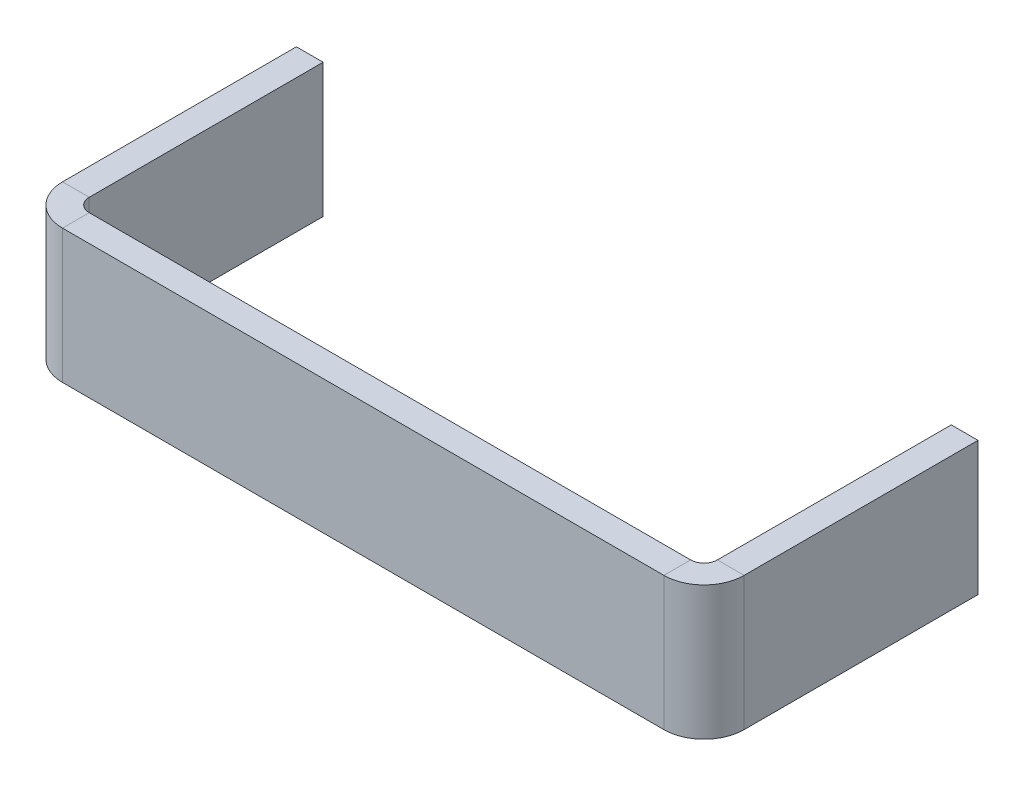
ISO-10303-21;
HEADER;
FILE_DESCRIPTION(('STEP AP214'),'2;1');
FILE_NAME('part.step','',(''),(''),'','','');
FILE_SCHEMA(('AUTOMOTIVE_DESIGN { 1 0 10303 214 1 1 1 1 }'));
ENDSEC;
DATA;
#1=APPLICATION_CONTEXT('core data for automotive mechanical design processes');
#2=APPLICATION_PROTOCOL_DEFINITION('international standard','automotive_design',2000,#1);
#3=PRODUCT_CONTEXT('',#1,'mechanical');
#4=PRODUCT('Part','Part','',(#3));
#5=PRODUCT_RELATED_PRODUCT_CATEGORY('part','',(#4));
#6=PRODUCT_DEFINITION_FORMATION('','',#4);
#7=PRODUCT_DEFINITION_CONTEXT('part definition',#1,'design');
#8=PRODUCT_DEFINITION('design','',#6,#7);
#9=PRODUCT_DEFINITION_SHAPE('','',#8);
#10=(LENGTH_UNIT() NAMED_UNIT(*) SI_UNIT(.MILLI.,.METRE.));
#11=(NAMED_UNIT(*) PLANE_ANGLE_UNIT() SI_UNIT($,.RADIAN.));
#12=(NAMED_UNIT(*) SI_UNIT($,.STERADIAN.) SOLID_ANGLE_UNIT());
#13=UNCERTAINTY_MEASURE_WITH_UNIT(LENGTH_MEASURE(1.E-05),#10,'distance_accuracy_value','');
#14=(GEOMETRIC_REPRESENTATION_CONTEXT(3) GLOBAL_UNCERTAINTY_ASSIGNED_CONTEXT((#13)) GLOBAL_UNIT_ASSIGNED_CONTEXT((#10,
#11,#12)) REPRESENTATION_CONTEXT('',''));
#15=CARTESIAN_POINT('',(0.,0.,0.));
#16=DIRECTION('',(0.,0.,1.));
#17=DIRECTION('',(1.,0.,0.));
#18=AXIS2_PLACEMENT_3D('',#15,#16,#17);
#19=CARTESIAN_POINT('',(1.5,10.,18.5));
#20=DIRECTION('',(0.,-1.,0.));
#21=DIRECTION('',(1.,0.,0.));
#22=AXIS2_PLACEMENT_3D('',#19,#20,#21);
#23=PLANE('',#22);
#24=DIRECTION('',(0.,0.,-1.));
#25=VECTOR('',#24,1.);
#26=CARTESIAN_POINT('',(2.5,10.,18.5));
#27=LINE('',#26,#25);
#28=CARTESIAN_POINT('',(2.5,10.,20.5));
#29=VERTEX_POINT('',#28);
#30=CARTESIAN_POINT('',(2.5,10.,18.5));
#31=VERTEX_POINT('',#30);
#32=EDGE_CURVE('E263',#29,#31,#27,.T.);
#33=ORIENTED_EDGE('',*,*,#32,.F.);
#34=DIRECTION('',(1.,0.,0.));
#35=VECTOR('',#34,1.);
#36=CARTESIAN_POINT('',(1.5,10.,20.5));
#37=LINE('',#36,#35);
#38=CARTESIAN_POINT('',(47.5,10.,20.5));
#39=VERTEX_POINT('',#38);
#40=EDGE_CURVE('E63',#29,#39,#37,.T.);
#41=ORIENTED_EDGE('',*,*,#40,.T.);
#42=DIRECTION('',(0.,0.,-1.));
#43=VECTOR('',#42,1.);
#44=CARTESIAN_POINT('',(47.5,10.,18.5));
#45=LINE('',#44,#43);
#46=CARTESIAN_POINT('',(47.5,10.,18.5));
#47=VERTEX_POINT('',#46);
#48=EDGE_CURVE('E271',#39,#47,#45,.T.);
#49=ORIENTED_EDGE('',*,*,#48,.T.);
#50=DIRECTION('',(1.,0.,0.));
#51=VECTOR('',#50,1.);
#52=CARTESIAN_POINT('',(1.5,10.,18.5));
#53=LINE('',#52,#51);
#54=EDGE_CURVE('E241',#31,#47,#53,.T.);
#55=ORIENTED_EDGE('',*,*,#54,.F.);
#56=EDGE_LOOP('',(#33,#41,#49,#55));
#57=FACE_BOUND('',#56,.T.);
#58=ADVANCED_FACE('F40',(#57),#23,.F.);
#59=CARTESIAN_POINT('',(0.,0.,18.5));
#60=DIRECTION('',(0.,-1.,0.));
#61=DIRECTION('',(1.,0.,0.));
#62=AXIS2_PLACEMENT_3D('',#59,#60,#61);
#63=PLANE('',#62);
#64=DIRECTION('',(0.,0.,-1.));
#65=VECTOR('',#64,1.);
#66=CARTESIAN_POINT('',(47.5,0.,18.5));
#67=LINE('',#66,#65);
#68=CARTESIAN_POINT('',(47.5,0.,20.5));
#69=VERTEX_POINT('',#68);
#70=CARTESIAN_POINT('',(47.5,0.,18.5));
#71=VERTEX_POINT('',#70);
#72=EDGE_CURVE('E11',#69,#71,#67,.T.);
#73=ORIENTED_EDGE('',*,*,#72,.F.);
#74=DIRECTION('',(1.,0.,0.));
#75=VECTOR('',#74,1.);
#76=CARTESIAN_POINT('',(1.5,0.,20.5));
#77=LINE('',#76,#75);
#78=CARTESIAN_POINT('',(2.5,0.,20.5));
#79=VERTEX_POINT('',#78);
#80=EDGE_CURVE('E55',#79,#69,#77,.T.);
#81=ORIENTED_EDGE('',*,*,#80,.F.);
#82=DIRECTION('',(0.,0.,-1.));
#83=VECTOR('',#82,1.);
#84=CARTESIAN_POINT('',(2.5,0.,18.5));
#85=LINE('',#84,#83);
#86=CARTESIAN_POINT('',(2.5,0.,18.5));
#87=VERTEX_POINT('',#86);
#88=EDGE_CURVE('E255',#79,#87,#85,.T.);
#89=ORIENTED_EDGE('',*,*,#88,.T.);
#90=DIRECTION('',(1.,0.,0.));
#91=VECTOR('',#90,1.);
#92=CARTESIAN_POINT('',(0.,0.,18.5));
#93=LINE('',#92,#91);
#94=EDGE_CURVE('E244',#87,#71,#93,.T.);
#95=ORIENTED_EDGE('',*,*,#94,.T.);
#96=EDGE_LOOP('',(#73,#81,#89,#95));
#97=FACE_BOUND('',#96,.T.);
#98=ADVANCED_FACE('F334',(#97),#63,.T.);
#99=CARTESIAN_POINT('',(1.5,-10.,18.5));
#100=DIRECTION('',(0.,0.,1.));
#101=DIRECTION('',(1.,0.,0.));
#102=AXIS2_PLACEMENT_3D('',#99,#100,#101);
#103=PLANE('',#102);
#104=ORIENTED_EDGE('',*,*,#54,.T.);
#105=DIRECTION('',(0.,-1.,0.));
#106=VECTOR('',#105,1.);
#107=CARTESIAN_POINT('',(47.5,0.,18.5));
#108=LINE('',#107,#106);
#109=EDGE_CURVE('E267',#47,#71,#108,.T.);
#110=ORIENTED_EDGE('',*,*,#109,.T.);
#111=ORIENTED_EDGE('',*,*,#94,.F.);
#112=DIRECTION('',(0.,1.,0.));
#113=VECTOR('',#112,1.);
#114=CARTESIAN_POINT('',(2.5,10.,18.5));
#115=LINE('',#114,#113);
#116=EDGE_CURVE('E247',#87,#31,#115,.T.);
#117=ORIENTED_EDGE('',*,*,#116,.T.);
#118=EDGE_LOOP('',(#104,#110,#111,#117));
#119=FACE_BOUND('',#118,.T.);
#120=ADVANCED_FACE('F288',(#119),#103,.F.);
#121=CARTESIAN_POINT('',(1.5,-10.,20.5));
#122=DIRECTION('',(0.,0.,1.));
#123=DIRECTION('',(1.,0.,0.));
#124=AXIS2_PLACEMENT_3D('',#121,#122,#123);
#125=PLANE('',#124);
#126=ORIENTED_EDGE('',*,*,#40,.F.);
#127=DIRECTION('',(0.,1.,0.));
#128=VECTOR('',#127,1.);
#129=CARTESIAN_POINT('',(2.5,-10.,20.5));
#130=LINE('',#129,#128);
#131=EDGE_CURVE('E259',#79,#29,#130,.T.);
#132=ORIENTED_EDGE('',*,*,#131,.F.);
#133=ORIENTED_EDGE('',*,*,#80,.T.);
#134=DIRECTION('',(0.,-1.,0.));
#135=VECTOR('',#134,1.);
#136=CARTESIAN_POINT('',(47.5,-10.,20.5));
#137=LINE('',#136,#135);
#138=EDGE_CURVE('E48',#39,#69,#137,.T.);
#139=ORIENTED_EDGE('',*,*,#138,.F.);
#140=EDGE_LOOP('',(#126,#132,#133,#139));
#141=FACE_BOUND('',#140,.T.);
#142=ADVANCED_FACE('F281',(#141),#125,.T.);
#143=CARTESIAN_POINT('',(2.5,10.,17.5));
#144=DIRECTION('',(0.,-1.,0.));
#145=DIRECTION('',(0.,0.,-1.));
#146=AXIS2_PLACEMENT_3D('',#143,#144,#145);
#147=PLANE('',#146);
#148=DIRECTION('',(1.,0.,0.));
#149=VECTOR('',#148,1.);
#150=CARTESIAN_POINT('',(1.49999999999999,10.,17.5));
#151=LINE('',#150,#149);
#152=CARTESIAN_POINT('',(-0.500000000000007,10.,17.5));
#153=VERTEX_POINT('',#152);
#154=CARTESIAN_POINT('',(1.49999999999999,10.,17.5));
#155=VERTEX_POINT('',#154);
#156=EDGE_CURVE('E184',#153,#155,#151,.T.);
#157=ORIENTED_EDGE('',*,*,#156,.F.);
#158=CARTESIAN_POINT('',(2.5,10.,17.5));
#159=DIRECTION('',(0.,1.,0.));
#160=DIRECTION('',(0.,0.,1.));
#161=AXIS2_PLACEMENT_3D('',#158,#159,#160);
#162=CIRCLE('',#161,3.);
#163=EDGE_CURVE('E188',#153,#29,#162,.T.);
#164=ORIENTED_EDGE('',*,*,#163,.T.);
#165=ORIENTED_EDGE('',*,*,#32,.T.);
#166=CARTESIAN_POINT('',(2.5,10.,17.5));
#167=DIRECTION('',(0.,1.,0.));
#168=DIRECTION('',(0.,0.,1.));
#169=AXIS2_PLACEMENT_3D('',#166,#167,#168);
#170=CIRCLE('',#169,1.);
#171=EDGE_CURVE('E226',#155,#31,#170,.T.);
#172=ORIENTED_EDGE('',*,*,#171,.F.);
#173=EDGE_LOOP('',(#157,#164,#165,#172));
#174=FACE_BOUND('',#173,.T.);
#175=ADVANCED_FACE('F294',(#174),#147,.F.);
#176=CARTESIAN_POINT('',(2.5,0.,17.5));
#177=DIRECTION('',(0.,1.,0.));
#178=DIRECTION('',(0.,0.,1.));
#179=AXIS2_PLACEMENT_3D('',#176,#177,#178);
#180=PLANE('',#179);
#181=ORIENTED_EDGE('',*,*,#88,.F.);
#182=CARTESIAN_POINT('',(2.5,0.,17.5));
#183=DIRECTION('',(0.,1.,0.));
#184=DIRECTION('',(0.,0.,1.));
#185=AXIS2_PLACEMENT_3D('',#182,#183,#184);
#186=CIRCLE('',#185,3.);
#187=CARTESIAN_POINT('',(-0.500000000000007,0.,17.5));
#188=VERTEX_POINT('',#187);
#189=EDGE_CURVE('E231',#79,#188,#186,.F.);
#190=ORIENTED_EDGE('',*,*,#189,.T.);
#191=DIRECTION('',(1.,0.,0.));
#192=VECTOR('',#191,1.);
#193=CARTESIAN_POINT('',(1.49999999999999,0.,17.5));
#194=LINE('',#193,#192);
#195=CARTESIAN_POINT('',(1.5,0.,17.5));
#196=VERTEX_POINT('',#195);
#197=EDGE_CURVE('E219',#188,#196,#194,.T.);
#198=ORIENTED_EDGE('',*,*,#197,.T.);
#199=CARTESIAN_POINT('',(2.5,0.,17.5));
#200=DIRECTION('',(0.,-1.,0.));
#201=DIRECTION('',(0.,0.,-1.));
#202=AXIS2_PLACEMENT_3D('',#199,#200,#201);
#203=CIRCLE('',#202,1.);
#204=EDGE_CURVE('E230',#87,#196,#203,.T.);
#205=ORIENTED_EDGE('',*,*,#204,.F.);
#206=EDGE_LOOP('',(#181,#190,#198,#205));
#207=FACE_BOUND('',#206,.T.);
#208=ADVANCED_FACE('F309',(#207),#180,.F.);
#209=CARTESIAN_POINT('',(2.5,-5.67097017150219,17.5));
#210=DIRECTION('',(0.,1.,0.));
#211=DIRECTION('',(0.,0.,1.));
#212=AXIS2_PLACEMENT_3D('',#209,#210,#211);
#213=CYLINDRICAL_SURFACE('',#212,1.);
#214=ORIENTED_EDGE('',*,*,#204,.T.);
#215=DIRECTION('',(0.,-1.,0.));
#216=VECTOR('',#215,1.);
#217=CARTESIAN_POINT('',(1.49999999999999,0.,17.5));
#218=LINE('',#217,#216);
#219=EDGE_CURVE('E206',#155,#196,#218,.T.);
#220=ORIENTED_EDGE('',*,*,#219,.F.);
#221=ORIENTED_EDGE('',*,*,#171,.T.);
#222=ORIENTED_EDGE('',*,*,#116,.F.);
#223=EDGE_LOOP('',(#214,#220,#221,#222));
#224=FACE_BOUND('',#223,.T.);
#225=ADVANCED_FACE('F297',(#224),#213,.F.);
#226=CARTESIAN_POINT('',(2.5,-5.67097017150219,17.5));
#227=DIRECTION('',(0.,1.,0.));
#228=DIRECTION('',(0.,0.,1.));
#229=AXIS2_PLACEMENT_3D('',#226,#227,#228);
#230=CYLINDRICAL_SURFACE('',#229,3.);
#231=ORIENTED_EDGE('',*,*,#189,.F.);
#232=ORIENTED_EDGE('',*,*,#131,.T.);
#233=ORIENTED_EDGE('',*,*,#163,.F.);
#234=DIRECTION('',(0.,-1.,0.));
#235=VECTOR('',#234,1.);
#236=CARTESIAN_POINT('',(-0.500000000000007,-10.,17.5));
#237=LINE('',#236,#235);
#238=EDGE_CURVE('E176',#153,#188,#237,.T.);
#239=ORIENTED_EDGE('',*,*,#238,.T.);
#240=EDGE_LOOP('',(#231,#232,#233,#239));
#241=FACE_BOUND('',#240,.T.);
#242=ADVANCED_FACE('F313',(#241),#230,.T.);
#243=CARTESIAN_POINT('',(1.49999999999999,0.,0.));
#244=DIRECTION('',(0.,0.,1.));
#245=DIRECTION('',(0.,1.,0.));
#246=AXIS2_PLACEMENT_3D('',#243,#244,#245);
#247=PLANE('',#246);
#248=DIRECTION('',(1.,0.,0.));
#249=VECTOR('',#248,1.);
#250=CARTESIAN_POINT('',(1.49999999999999,0.,0.));
#251=LINE('',#250,#249);
#252=CARTESIAN_POINT('',(-0.500000000000007,0.,0.));
#253=VERTEX_POINT('',#252);
#254=CARTESIAN_POINT('',(1.49999999999999,0.,0.));
#255=VERTEX_POINT('',#254);
#256=EDGE_CURVE('E199',#253,#255,#251,.T.);
#257=ORIENTED_EDGE('',*,*,#256,.F.);
#258=DIRECTION('',(0.,1.,0.));
#259=VECTOR('',#258,1.);
#260=CARTESIAN_POINT('',(-0.500000000000007,-10.,0.));
#261=LINE('',#260,#259);
#262=CARTESIAN_POINT('',(-0.500000000000007,10.,0.));
#263=VERTEX_POINT('',#262);
#264=EDGE_CURVE('E215',#253,#263,#261,.T.);
#265=ORIENTED_EDGE('',*,*,#264,.T.);
#266=DIRECTION('',(1.,0.,0.));
#267=VECTOR('',#266,1.);
#268=CARTESIAN_POINT('',(1.49999999999999,10.,0.));
#269=LINE('',#268,#267);
#270=CARTESIAN_POINT('',(1.49999999999999,10.,0.));
#271=VERTEX_POINT('',#270);
#272=EDGE_CURVE('E212',#263,#271,#269,.T.);
#273=ORIENTED_EDGE('',*,*,#272,.T.);
#274=DIRECTION('',(0.,1.,0.));
#275=VECTOR('',#274,1.);
#276=CARTESIAN_POINT('',(1.49999999999999,0.,0.));
#277=LINE('',#276,#275);
#278=EDGE_CURVE('E202',#255,#271,#277,.T.);
#279=ORIENTED_EDGE('',*,*,#278,.F.);
#280=EDGE_LOOP('',(#257,#265,#273,#279));
#281=FACE_BOUND('',#280,.T.);
#282=ADVANCED_FACE('F321',(#281),#247,.F.);
#283=CARTESIAN_POINT('',(1.49999999999999,-10.,0.));
#284=DIRECTION('',(-1.,0.,0.));
#285=DIRECTION('',(0.,0.,1.));
#286=AXIS2_PLACEMENT_3D('',#283,#284,#285);
#287=PLANE('',#286);
#288=DIRECTION('',(0.,0.,1.));
#289=VECTOR('',#288,1.);
#290=CARTESIAN_POINT('',(1.49999999999999,10.,0.));
#291=LINE('',#290,#289);
#292=EDGE_CURVE('E209',#271,#155,#291,.T.);
#293=ORIENTED_EDGE('',*,*,#292,.T.);
#294=ORIENTED_EDGE('',*,*,#219,.T.);
#295=DIRECTION('',(0.,0.,1.));
#296=VECTOR('',#295,1.);
#297=CARTESIAN_POINT('',(1.49999999999999,0.,20.));
#298=LINE('',#297,#296);
#299=EDGE_CURVE('E195',#255,#196,#298,.T.);
#300=ORIENTED_EDGE('',*,*,#299,.F.);
#301=ORIENTED_EDGE('',*,*,#278,.T.);
#302=EDGE_LOOP('',(#293,#294,#300,#301));
#303=FACE_BOUND('',#302,.T.);
#304=ADVANCED_FACE('F300',(#303),#287,.F.);
#305=CARTESIAN_POINT('',(1.49999999999999,0.,20.));
#306=DIRECTION('',(0.,-1.,0.));
#307=DIRECTION('',(0.,0.,1.));
#308=AXIS2_PLACEMENT_3D('',#305,#306,#307);
#309=PLANE('',#308);
#310=ORIENTED_EDGE('',*,*,#197,.F.);
#311=DIRECTION('',(0.,0.,1.));
#312=VECTOR('',#311,1.);
#313=CARTESIAN_POINT('',(-0.500000000000007,0.,0.));
#314=LINE('',#313,#312);
#315=EDGE_CURVE('E192',#253,#188,#314,.T.);
#316=ORIENTED_EDGE('',*,*,#315,.F.);
#317=ORIENTED_EDGE('',*,*,#256,.T.);
#318=ORIENTED_EDGE('',*,*,#299,.T.);
#319=EDGE_LOOP('',(#310,#316,#317,#318));
#320=FACE_BOUND('',#319,.T.);
#321=ADVANCED_FACE('F304',(#320),#309,.T.);
#322=CARTESIAN_POINT('',(-0.500000000000007,-10.,0.));
#323=DIRECTION('',(-1.,0.,0.));
#324=DIRECTION('',(0.,0.,1.));
#325=AXIS2_PLACEMENT_3D('',#322,#323,#324);
#326=PLANE('',#325);
#327=DIRECTION('',(0.,0.,1.));
#328=VECTOR('',#327,1.);
#329=CARTESIAN_POINT('',(-0.500000000000007,10.,0.));
#330=LINE('',#329,#328);
#331=EDGE_CURVE('E189',#263,#153,#330,.T.);
#332=ORIENTED_EDGE('',*,*,#331,.F.);
#333=ORIENTED_EDGE('',*,*,#264,.F.);
#334=ORIENTED_EDGE('',*,*,#315,.T.);
#335=ORIENTED_EDGE('',*,*,#238,.F.);
#336=EDGE_LOOP('',(#332,#333,#334,#335));
#337=FACE_BOUND('',#336,.T.);
#338=ADVANCED_FACE('F316',(#337),#326,.T.);
#339=CARTESIAN_POINT('',(1.49999999999999,10.,0.));
#340=DIRECTION('',(0.,-1.,0.));
#341=DIRECTION('',(0.,0.,1.));
#342=AXIS2_PLACEMENT_3D('',#339,#340,#341);
#343=PLANE('',#342);
#344=ORIENTED_EDGE('',*,*,#272,.F.);
#345=ORIENTED_EDGE('',*,*,#331,.T.);
#346=ORIENTED_EDGE('',*,*,#156,.T.);
#347=ORIENTED_EDGE('',*,*,#292,.F.);
#348=EDGE_LOOP('',(#344,#345,#346,#347));
#349=FACE_BOUND('',#348,.T.);
#350=ADVANCED_FACE('F319',(#349),#343,.F.);
#351=CARTESIAN_POINT('',(47.5,10.,17.5));
#352=DIRECTION('',(0.,-1.,0.));
#353=DIRECTION('',(0.,0.,-1.));
#354=AXIS2_PLACEMENT_3D('',#351,#352,#353);
#355=PLANE('',#354);
#356=ORIENTED_EDGE('',*,*,#48,.F.);
#357=CARTESIAN_POINT('',(47.5,10.,17.5));
#358=DIRECTION('',(0.,-1.,0.));
#359=DIRECTION('',(0.,0.,-1.));
#360=AXIS2_PLACEMENT_3D('',#357,#358,#359);
#361=CIRCLE('',#360,3.);
#362=CARTESIAN_POINT('',(50.5,10.,17.5));
#363=VERTEX_POINT('',#362);
#364=EDGE_CURVE('E180',#39,#363,#361,.F.);
#365=ORIENTED_EDGE('',*,*,#364,.T.);
#366=DIRECTION('',(-1.,0.,0.));
#367=VECTOR('',#366,1.);
#368=CARTESIAN_POINT('',(48.5,10.,17.5));
#369=LINE('',#368,#367);
#370=CARTESIAN_POINT('',(48.5,10.,17.5));
#371=VERTEX_POINT('',#370);
#372=EDGE_CURVE('E157',#363,#371,#369,.T.);
#373=ORIENTED_EDGE('',*,*,#372,.T.);
#374=CARTESIAN_POINT('',(47.5,10.,17.5));
#375=DIRECTION('',(0.,1.,0.));
#376=DIRECTION('',(0.,0.,1.));
#377=AXIS2_PLACEMENT_3D('',#374,#375,#376);
#378=CIRCLE('',#377,1.);
#379=EDGE_CURVE('E167',#47,#371,#378,.T.);
#380=ORIENTED_EDGE('',*,*,#379,.F.);
#381=EDGE_LOOP('',(#356,#365,#373,#380));
#382=FACE_BOUND('',#381,.T.);
#383=ADVANCED_FACE('F284',(#382),#355,.F.);
#384=CARTESIAN_POINT('',(47.5,0.,17.5));
#385=DIRECTION('',(0.,1.,0.));
#386=DIRECTION('',(0.,0.,1.));
#387=AXIS2_PLACEMENT_3D('',#384,#385,#386);
#388=PLANE('',#387);
#389=DIRECTION('',(-1.,0.,0.));
#390=VECTOR('',#389,1.);
#391=CARTESIAN_POINT('',(48.5,0.,17.5));
#392=LINE('',#391,#390);
#393=CARTESIAN_POINT('',(50.5,0.,17.5));
#394=VERTEX_POINT('',#393);
#395=CARTESIAN_POINT('',(48.5,0.,17.5));
#396=VERTEX_POINT('',#395);
#397=EDGE_CURVE('E152',#394,#396,#392,.T.);
#398=ORIENTED_EDGE('',*,*,#397,.F.);
#399=CARTESIAN_POINT('',(47.5,0.,17.5));
#400=DIRECTION('',(0.,-1.,0.));
#401=DIRECTION('',(0.,0.,-1.));
#402=AXIS2_PLACEMENT_3D('',#399,#400,#401);
#403=CIRCLE('',#402,3.);
#404=EDGE_CURVE('E172',#394,#69,#403,.T.);
#405=ORIENTED_EDGE('',*,*,#404,.T.);
#406=ORIENTED_EDGE('',*,*,#72,.T.);
#407=CARTESIAN_POINT('',(47.5,0.,17.5));
#408=DIRECTION('',(0.,-1.,0.));
#409=DIRECTION('',(0.,0.,-1.));
#410=AXIS2_PLACEMENT_3D('',#407,#408,#409);
#411=CIRCLE('',#410,1.);
#412=EDGE_CURVE('E171',#396,#71,#411,.T.);
#413=ORIENTED_EDGE('',*,*,#412,.F.);
#414=EDGE_LOOP('',(#398,#405,#406,#413));
#415=FACE_BOUND('',#414,.T.);
#416=ADVANCED_FACE('F374',(#415),#388,.F.);
#417=CARTESIAN_POINT('',(47.5,15.6709701715022,17.5));
#418=DIRECTION('',(0.,-1.,0.));
#419=DIRECTION('',(0.,0.,-1.));
#420=AXIS2_PLACEMENT_3D('',#417,#418,#419);
#421=CYLINDRICAL_SURFACE('',#420,1.);
#422=ORIENTED_EDGE('',*,*,#412,.T.);
#423=ORIENTED_EDGE('',*,*,#109,.F.);
#424=ORIENTED_EDGE('',*,*,#379,.T.);
#425=DIRECTION('',(0.,1.,0.));
#426=VECTOR('',#425,1.);
#427=CARTESIAN_POINT('',(48.5,10.,17.5));
#428=LINE('',#427,#426);
#429=EDGE_CURVE('E141',#396,#371,#428,.T.);
#430=ORIENTED_EDGE('',*,*,#429,.F.);
#431=EDGE_LOOP('',(#422,#423,#424,#430));
#432=FACE_BOUND('',#431,.T.);
#433=ADVANCED_FACE('F380',(#432),#421,.F.);
#434=CARTESIAN_POINT('',(47.5,15.6709701715022,17.5));
#435=DIRECTION('',(0.,-1.,0.));
#436=DIRECTION('',(0.,0.,-1.));
#437=AXIS2_PLACEMENT_3D('',#434,#435,#436);
#438=CYLINDRICAL_SURFACE('',#437,3.);
#439=ORIENTED_EDGE('',*,*,#404,.F.);
#440=DIRECTION('',(0.,1.,0.));
#441=VECTOR('',#440,1.);
#442=CARTESIAN_POINT('',(50.5,-10.,17.5));
#443=LINE('',#442,#441);
#444=EDGE_CURVE('E149',#394,#363,#443,.T.);
#445=ORIENTED_EDGE('',*,*,#444,.T.);
#446=ORIENTED_EDGE('',*,*,#364,.F.);
#447=ORIENTED_EDGE('',*,*,#138,.T.);
#448=EDGE_LOOP('',(#439,#445,#446,#447));
#449=FACE_BOUND('',#448,.T.);
#450=ADVANCED_FACE('F279',(#449),#438,.T.);
#451=CARTESIAN_POINT('',(48.5,0.,0.));
#452=DIRECTION('',(0.,0.,1.));
#453=DIRECTION('',(0.,-1.,0.));
#454=AXIS2_PLACEMENT_3D('',#451,#452,#453);
#455=PLANE('',#454);
#456=DIRECTION('',(-1.,0.,0.));
#457=VECTOR('',#456,1.);
#458=CARTESIAN_POINT('',(48.5,10.,0.));
#459=LINE('',#458,#457);
#460=CARTESIAN_POINT('',(50.5,10.,0.));
#461=VERTEX_POINT('',#460);
#462=CARTESIAN_POINT('',(48.5,10.,0.));
#463=VERTEX_POINT('',#462);
#464=EDGE_CURVE('E153',#461,#463,#459,.T.);
#465=ORIENTED_EDGE('',*,*,#464,.F.);
#466=DIRECTION('',(0.,1.,0.));
#467=VECTOR('',#466,1.);
#468=CARTESIAN_POINT('',(50.5,-10.,0.));
#469=LINE('',#468,#467);
#470=CARTESIAN_POINT('',(50.5,0.,0.));
#471=VERTEX_POINT('',#470);
#472=EDGE_CURVE('E142',#461,#471,#469,.F.);
#473=ORIENTED_EDGE('',*,*,#472,.T.);
#474=DIRECTION('',(-1.,0.,0.));
#475=VECTOR('',#474,1.);
#476=CARTESIAN_POINT('',(48.5,0.,0.));
#477=LINE('',#476,#475);
#478=CARTESIAN_POINT('',(48.5,0.,0.));
#479=VERTEX_POINT('',#478);
#480=EDGE_CURVE('E129',#471,#479,#477,.T.);
#481=ORIENTED_EDGE('',*,*,#480,.T.);
#482=DIRECTION('',(0.,-1.,0.));
#483=VECTOR('',#482,1.);
#484=CARTESIAN_POINT('',(48.5,0.,0.));
#485=LINE('',#484,#483);
#486=EDGE_CURVE('E635',#463,#479,#485,.T.);
#487=ORIENTED_EDGE('',*,*,#486,.F.);
#488=EDGE_LOOP('',(#465,#473,#481,#487));
#489=FACE_BOUND('',#488,.T.);
#490=ADVANCED_FACE('F155',(#489),#455,.F.);
#491=CARTESIAN_POINT('',(48.5,-10.,0.));
#492=DIRECTION('',(1.,0.,0.));
#493=DIRECTION('',(0.,0.,-1.));
#494=AXIS2_PLACEMENT_3D('',#491,#492,#493);
#495=PLANE('',#494);
#496=DIRECTION('',(0.,0.,-1.));
#497=VECTOR('',#496,1.);
#498=CARTESIAN_POINT('',(48.5,0.,20.));
#499=LINE('',#498,#497);
#500=EDGE_CURVE('E135',#396,#479,#499,.T.);
#501=ORIENTED_EDGE('',*,*,#500,.F.);
#502=ORIENTED_EDGE('',*,*,#429,.T.);
#503=DIRECTION('',(0.,0.,-1.));
#504=VECTOR('',#503,1.);
#505=CARTESIAN_POINT('',(48.5,10.,0.));
#506=LINE('',#505,#504);
#507=EDGE_CURVE('E622',#371,#463,#506,.T.);
#508=ORIENTED_EDGE('',*,*,#507,.T.);
#509=ORIENTED_EDGE('',*,*,#486,.T.);
#510=EDGE_LOOP('',(#501,#502,#508,#509));
#511=FACE_BOUND('',#510,.T.);
#512=ADVANCED_FACE('F399',(#511),#495,.F.);
#513=CARTESIAN_POINT('',(48.5,10.,0.));
#514=DIRECTION('',(0.,-1.,0.));
#515=DIRECTION('',(0.,0.,-1.));
#516=AXIS2_PLACEMENT_3D('',#513,#514,#515);
#517=PLANE('',#516);
#518=ORIENTED_EDGE('',*,*,#372,.F.);
#519=DIRECTION('',(0.,0.,-1.));
#520=VECTOR('',#519,1.);
#521=CARTESIAN_POINT('',(50.5,10.,0.));
#522=LINE('',#521,#520);
#523=EDGE_CURVE('E620',#363,#461,#522,.T.);
#524=ORIENTED_EDGE('',*,*,#523,.T.);
#525=ORIENTED_EDGE('',*,*,#464,.T.);
#526=ORIENTED_EDGE('',*,*,#507,.F.);
#527=EDGE_LOOP('',(#518,#524,#525,#526));
#528=FACE_BOUND('',#527,.T.);
#529=ADVANCED_FACE('F403',(#528),#517,.F.);
#530=CARTESIAN_POINT('',(50.5,-10.,0.));
#531=DIRECTION('',(1.,0.,0.));
#532=DIRECTION('',(0.,0.,-1.));
#533=AXIS2_PLACEMENT_3D('',#530,#531,#532);
#534=PLANE('',#533);
#535=DIRECTION('',(0.,0.,-1.));
#536=VECTOR('',#535,1.);
#537=CARTESIAN_POINT('',(50.5,0.,0.));
#538=LINE('',#537,#536);
#539=EDGE_CURVE('E132',#394,#471,#538,.T.);
#540=ORIENTED_EDGE('',*,*,#539,.T.);
#541=ORIENTED_EDGE('',*,*,#472,.F.);
#542=ORIENTED_EDGE('',*,*,#523,.F.);
#543=ORIENTED_EDGE('',*,*,#444,.F.);
#544=EDGE_LOOP('',(#540,#541,#542,#543));
#545=FACE_BOUND('',#544,.T.);
#546=ADVANCED_FACE('F146',(#545),#534,.T.);
#547=CARTESIAN_POINT('',(48.5,0.,20.));
#548=DIRECTION('',(0.,-1.,0.));
#549=DIRECTION('',(0.,0.,-1.));
#550=AXIS2_PLACEMENT_3D('',#547,#548,#549);
#551=PLANE('',#550);
#552=ORIENTED_EDGE('',*,*,#480,.F.);
#553=ORIENTED_EDGE('',*,*,#539,.F.);
#554=ORIENTED_EDGE('',*,*,#397,.T.);
#555=ORIENTED_EDGE('',*,*,#500,.T.);
#556=EDGE_LOOP('',(#552,#553,#554,#555));
#557=FACE_BOUND('',#556,.T.);
#558=ADVANCED_FACE('F131',(#557),#551,.T.);
#559=CLOSED_SHELL('',(#58,#98,#120,#142,#175,#208,#225,#242,#282,#304,#321,#338,#350,#383,#416,
#433,#450,#490,#512,#529,#546,#558));
#560=MANIFOLD_SOLID_BREP('B2',#559);
#561=ADVANCED_BREP_SHAPE_REPRESENTATION('',(#18,#560),#14);
#562=SHAPE_DEFINITION_REPRESENTATION(#9,#561);
ENDSEC;
END-ISO-10303-21;
